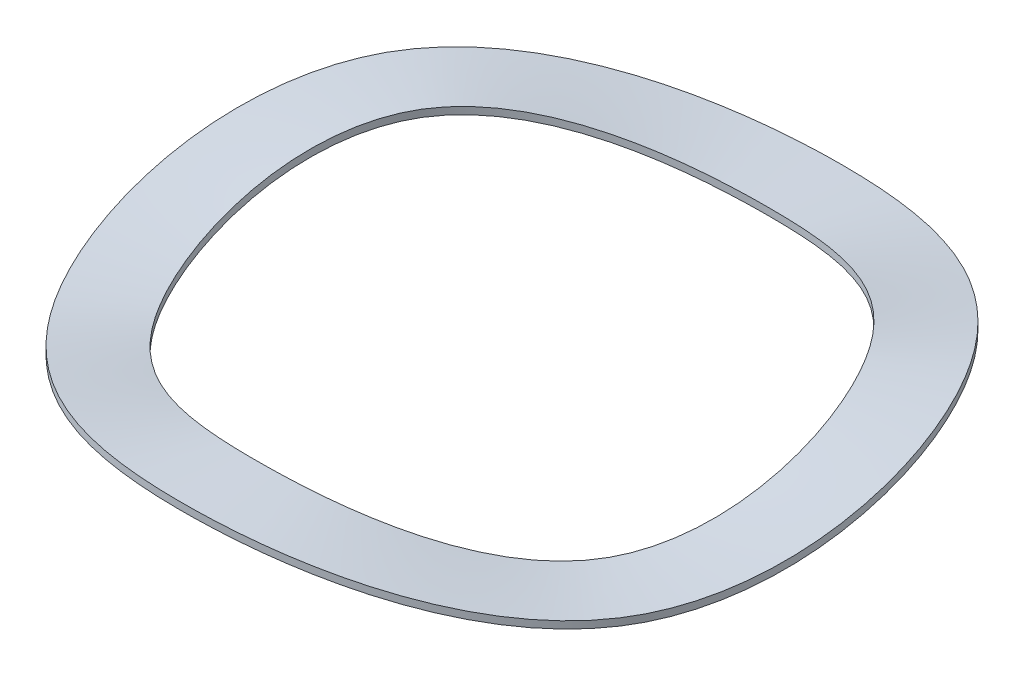
ISO-10303-21;
HEADER;
FILE_DESCRIPTION(('STEP AP214'),'2;1');
FILE_NAME('part.step','',(''),(''),'','','');
FILE_SCHEMA(('AUTOMOTIVE_DESIGN { 1 0 10303 214 1 1 1 1 }'));
ENDSEC;
DATA;
#1=APPLICATION_CONTEXT('core data for automotive mechanical design processes');
#2=APPLICATION_PROTOCOL_DEFINITION('international standard','automotive_design',2000,#1);
#3=PRODUCT_CONTEXT('',#1,'mechanical');
#4=PRODUCT('Part','Part','',(#3));
#5=PRODUCT_RELATED_PRODUCT_CATEGORY('part','',(#4));
#6=PRODUCT_DEFINITION_FORMATION('','',#4);
#7=PRODUCT_DEFINITION_CONTEXT('part definition',#1,'design');
#8=PRODUCT_DEFINITION('design','',#6,#7);
#9=PRODUCT_DEFINITION_SHAPE('','',#8);
#10=(LENGTH_UNIT() NAMED_UNIT(*) SI_UNIT(.MILLI.,.METRE.));
#11=(NAMED_UNIT(*) PLANE_ANGLE_UNIT() SI_UNIT($,.RADIAN.));
#12=(NAMED_UNIT(*) SI_UNIT($,.STERADIAN.) SOLID_ANGLE_UNIT());
#13=UNCERTAINTY_MEASURE_WITH_UNIT(LENGTH_MEASURE(1.E-05),#10,'distance_accuracy_value','');
#14=(GEOMETRIC_REPRESENTATION_CONTEXT(3) GLOBAL_UNCERTAINTY_ASSIGNED_CONTEXT((#13)) GLOBAL_UNIT_ASSIGNED_CONTEXT((#10,
#11,#12)) REPRESENTATION_CONTEXT('',''));
#15=CARTESIAN_POINT('',(0.,0.,0.));
#16=DIRECTION('',(0.,0.,1.));
#17=DIRECTION('',(1.,0.,0.));
#18=AXIS2_PLACEMENT_3D('',#15,#16,#17);
#19=CARTESIAN_POINT('',(0.,0.,-10.8712));
#20=CARTESIAN_POINT('',(3.76589414784855,0.,-10.8712));
#21=CARTESIAN_POINT('',(11.2976824435457,3.2004,-6.52272));
#22=CARTESIAN_POINT('',(11.2976824435456,-1.6002,6.52272000000004));
#23=CARTESIAN_POINT('',(0.,3.20039999999999,13.04544));
#24=CARTESIAN_POINT('',(-11.2976824435457,-1.6002,6.52271999999994));
#25=CARTESIAN_POINT('',(-11.2976824435456,1.6002,-2.17424000000005));
#26=CARTESIAN_POINT('',(-7.53178829569708,1.6002,-8.69696000000003));
#27=CARTESIAN_POINT('',(-3.76589414784855,0.,-10.8712));
#28=CARTESIAN_POINT('',(0.,0.,-10.8712));
#29=CARTESIAN_POINT('',(0.,0.,-11.9126));
#30=CARTESIAN_POINT('',(4.126645690049,0.,-11.9126));
#31=CARTESIAN_POINT('',(12.379937070147,3.2004,-7.14756000000001));
#32=CARTESIAN_POINT('',(12.379937070147,-1.6002,7.14756000000004));
#33=CARTESIAN_POINT('',(0.,3.20039999999999,14.29512));
#34=CARTESIAN_POINT('',(-12.3799370701471,-1.6002,7.14755999999993));
#35=CARTESIAN_POINT('',(-12.379937070147,1.6002,-2.38252000000005));
#36=CARTESIAN_POINT('',(-8.25329138009797,1.6002,-9.53008000000003));
#37=CARTESIAN_POINT('',(-4.12664569004899,0.,-11.9126));
#38=CARTESIAN_POINT('',(0.,0.,-11.9126));
#39=CARTESIAN_POINT('',(0.,0.,-12.954));
#40=CARTESIAN_POINT('',(4.48739723224945,0.,-12.954));
#41=CARTESIAN_POINT('',(13.4621916967484,3.2004,-7.77240000000001));
#42=CARTESIAN_POINT('',(13.4621916967483,-1.6002,7.77240000000005));
#43=CARTESIAN_POINT('',(0.,3.20039999999999,15.5448));
#44=CARTESIAN_POINT('',(-13.4621916967484,-1.6002,7.77239999999993));
#45=CARTESIAN_POINT('',(-13.4621916967483,1.6002,-2.59080000000006));
#46=CARTESIAN_POINT('',(-8.97479446449886,1.6002,-10.3632));
#47=CARTESIAN_POINT('',(-4.48739723224944,0.,-12.954));
#48=CARTESIAN_POINT('',(0.,0.,-12.954));
#49=CARTESIAN_POINT('',(0.,0.,-13.9954));
#50=CARTESIAN_POINT('',(4.84814877444989,0.,-13.9954));
#51=CARTESIAN_POINT('',(14.5444463233497,3.2004,-8.39724000000001));
#52=CARTESIAN_POINT('',(14.5444463233496,-1.6002,8.39724000000005));
#53=CARTESIAN_POINT('',(0.,3.20039999999999,16.79448));
#54=CARTESIAN_POINT('',(-14.5444463233498,-1.6002,8.39723999999993));
#55=CARTESIAN_POINT('',(-14.5444463233497,1.6002,-2.79908000000007));
#56=CARTESIAN_POINT('',(-9.69629754889975,1.6002,-11.19632));
#57=CARTESIAN_POINT('',(-4.84814877444989,0.,-13.9954));
#58=CARTESIAN_POINT('',(0.,0.,-13.9954));
#59=B_SPLINE_SURFACE_WITH_KNOTS('',3,3,((#19,#20,#21,#22,#23,#24,#25,#26,#27,#28),(#29,#30,#31,
#32,#33,#34,#35,#36,#37,#38),(#39,#40,#41,#42,#43,#44,#45,#46,#47,#48),(#49,#50,#51,#52,#53,#54,
#55,#56,#57,#58)),.UNSPECIFIED.,.F.,.T.,.F.,(4,4),(4,1,1,1,1,2,4),(0.,1.),(0.,0.166666666666667,
0.333333333333334,0.5,0.666666666666666,0.833333333333333,1.),.UNSPECIFIED.);
#60=CARTESIAN_POINT('',(0.,0.,-10.8712));
#61=CARTESIAN_POINT('',(3.76589414784855,0.,-10.8712));
#62=CARTESIAN_POINT('',(11.2976824435457,3.2004,-6.52272));
#63=CARTESIAN_POINT('',(11.2976824435456,-1.6002,6.52272000000004));
#64=CARTESIAN_POINT('',(0.,3.20039999999999,13.04544));
#65=CARTESIAN_POINT('',(-11.2976824435457,-1.6002,6.52271999999994));
#66=CARTESIAN_POINT('',(-11.2976824435456,1.6002,-2.17424000000005));
#67=CARTESIAN_POINT('',(-7.53178829569708,1.6002,-8.69696000000003));
#68=CARTESIAN_POINT('',(-3.76589414784855,0.,-10.8712));
#69=CARTESIAN_POINT('',(0.,0.,-10.8712));
#70=B_SPLINE_CURVE_WITH_KNOTS('',3,(#60,#61,#62,#63,#64,#65,#66,#67,#68,#69),.UNSPECIFIED.,.T.,
.F.,(4,1,1,1,1,2,4),(0.,0.166666666666667,0.333333333333334,0.5,0.666666666666666,
0.833333333333333,1.),.UNSPECIFIED.);
#71=CARTESIAN_POINT('',(0.,0.,-10.8712));
#72=VERTEX_POINT('',#71);
#73=EDGE_CURVE('E31',#72,#72,#70,.T.);
#74=CARTESIAN_POINT('',(0.,0.,-13.9954));
#75=CARTESIAN_POINT('',(4.84814877444989,0.,-13.9954));
#76=CARTESIAN_POINT('',(14.5444463233497,3.2004,-8.39724000000001));
#77=CARTESIAN_POINT('',(14.5444463233496,-1.6002,8.39724000000005));
#78=CARTESIAN_POINT('',(0.,3.20039999999999,16.79448));
#79=CARTESIAN_POINT('',(-14.5444463233498,-1.6002,8.39723999999993));
#80=CARTESIAN_POINT('',(-14.5444463233497,1.6002,-2.79908000000007));
#81=CARTESIAN_POINT('',(-9.69629754889975,1.6002,-11.19632));
#82=CARTESIAN_POINT('',(-4.84814877444989,0.,-13.9954));
#83=CARTESIAN_POINT('',(0.,0.,-13.9954));
#84=B_SPLINE_CURVE_WITH_KNOTS('',3,(#74,#75,#76,#77,#78,#79,#80,#81,#82,#83),.UNSPECIFIED.,.T.,
.F.,(4,1,1,1,1,2,4),(0.,0.166666666666667,0.333333333333334,0.5,0.666666666666666,
0.833333333333333,1.),.UNSPECIFIED.);
#85=CARTESIAN_POINT('',(0.,0.,-13.9954));
#86=VERTEX_POINT('',#85);
#87=EDGE_CURVE('E20',#86,#86,#84,.F.);
#88=ORIENTED_EDGE('',*,*,#73,.F.);
#89=EDGE_LOOP('',(#88));
#90=FACE_BOUND('',#89,.T.);
#91=ORIENTED_EDGE('',*,*,#87,.F.);
#92=EDGE_LOOP('',(#91));
#93=FACE_BOUND('',#92,.T.);
#94=ADVANCED_FACE('F14',(#90,#93),#59,.T.);
#95=CARTESIAN_POINT('',(0.,0.,-13.9954));
#96=CARTESIAN_POINT('',(4.84814877444989,0.,-13.9954));
#97=CARTESIAN_POINT('',(14.5444463233497,3.2004,-8.39724000000001));
#98=CARTESIAN_POINT('',(14.5444463233496,-1.6002,8.39724000000005));
#99=CARTESIAN_POINT('',(0.,3.20039999999999,16.79448));
#100=CARTESIAN_POINT('',(-14.5444463233498,-1.6002,8.39723999999993));
#101=CARTESIAN_POINT('',(-14.5444463233497,1.6002,-2.79908000000007));
#102=CARTESIAN_POINT('',(-9.69629754889975,1.6002,-11.19632));
#103=CARTESIAN_POINT('',(-4.84814877444989,0.,-13.9954));
#104=CARTESIAN_POINT('',(0.,0.,-13.9954));
#105=CARTESIAN_POINT('',(0.,0.1016,-13.9954));
#106=CARTESIAN_POINT('',(4.84814877444989,0.101599999999999,-13.9954));
#107=CARTESIAN_POINT('',(14.5444463233497,3.302,-8.39724000000001));
#108=CARTESIAN_POINT('',(14.5444463233496,-1.4986,8.39724000000005));
#109=CARTESIAN_POINT('',(0.,3.30199999999999,16.79448));
#110=CARTESIAN_POINT('',(-14.5444463233498,-1.4986,8.39723999999993));
#111=CARTESIAN_POINT('',(-14.5444463233497,1.7018,-2.79908000000007));
#112=CARTESIAN_POINT('',(-9.69629754889975,1.7018,-11.19632));
#113=CARTESIAN_POINT('',(-4.84814877444989,0.101600000000001,-13.9954));
#114=CARTESIAN_POINT('',(0.,0.1016,-13.9954));
#115=CARTESIAN_POINT('',(0.,0.2032,-13.9954));
#116=CARTESIAN_POINT('',(4.84814877444989,0.203199999999999,-13.9954));
#117=CARTESIAN_POINT('',(14.5444463233497,3.4036,-8.39724000000001));
#118=CARTESIAN_POINT('',(14.5444463233496,-1.397,8.39724000000005));
#119=CARTESIAN_POINT('',(0.,3.40359999999999,16.79448));
#120=CARTESIAN_POINT('',(-14.5444463233498,-1.397,8.39723999999993));
#121=CARTESIAN_POINT('',(-14.5444463233497,1.8034,-2.79908000000007));
#122=CARTESIAN_POINT('',(-9.69629754889975,1.8034,-11.19632));
#123=CARTESIAN_POINT('',(-4.84814877444989,0.203200000000001,-13.9954));
#124=CARTESIAN_POINT('',(0.,0.2032,-13.9954));
#125=CARTESIAN_POINT('',(0.,0.3048,-13.9954));
#126=CARTESIAN_POINT('',(4.84814877444989,0.304799999999999,-13.9954));
#127=CARTESIAN_POINT('',(14.5444463233497,3.5052,-8.39724000000001));
#128=CARTESIAN_POINT('',(14.5444463233496,-1.2954,8.39724000000005));
#129=CARTESIAN_POINT('',(0.,3.50519999999999,16.79448));
#130=CARTESIAN_POINT('',(-14.5444463233498,-1.2954,8.39723999999993));
#131=CARTESIAN_POINT('',(-14.5444463233497,1.905,-2.79908000000007));
#132=CARTESIAN_POINT('',(-9.69629754889975,1.905,-11.19632));
#133=CARTESIAN_POINT('',(-4.84814877444989,0.304800000000001,-13.9954));
#134=CARTESIAN_POINT('',(0.,0.3048,-13.9954));
#135=B_SPLINE_SURFACE_WITH_KNOTS('',3,3,((#95,#96,#97,#98,#99,#100,#101,#102,#103,#104),(#105,
#106,#107,#108,#109,#110,#111,#112,#113,#114),(#115,#116,#117,#118,#119,#120,#121,#122,#123,
#124),(#125,#126,#127,#128,#129,#130,#131,#132,#133,#134)),.UNSPECIFIED.,.F.,.T.,.F.,(4,4),(4,1,
1,1,1,2,4),(0.,1.),(0.,0.166666666666667,0.333333333333334,0.5,0.666666666666666,
0.833333333333333,1.),.UNSPECIFIED.);
#136=CARTESIAN_POINT('',(0.,0.3048,-13.9954));
#137=CARTESIAN_POINT('',(4.84814877444989,0.304799999999999,-13.9954));
#138=CARTESIAN_POINT('',(14.5444463233497,3.5052,-8.39724000000001));
#139=CARTESIAN_POINT('',(14.5444463233496,-1.2954,8.39724000000005));
#140=CARTESIAN_POINT('',(0.,3.50519999999999,16.79448));
#141=CARTESIAN_POINT('',(-14.5444463233498,-1.2954,8.39723999999993));
#142=CARTESIAN_POINT('',(-14.5444463233497,1.905,-2.79908000000007));
#143=CARTESIAN_POINT('',(-9.69629754889975,1.905,-11.19632));
#144=CARTESIAN_POINT('',(-4.84814877444989,0.304800000000001,-13.9954));
#145=CARTESIAN_POINT('',(0.,0.3048,-13.9954));
#146=B_SPLINE_CURVE_WITH_KNOTS('',3,(#136,#137,#138,#139,#140,#141,#142,#143,#144,#145),
.UNSPECIFIED.,.T.,.F.,(4,1,1,1,1,2,4),(0.,0.166666666666667,0.333333333333334,0.5,
0.666666666666666,0.833333333333333,1.),.UNSPECIFIED.);
#147=CARTESIAN_POINT('',(0.,0.3048,-13.9954));
#148=VERTEX_POINT('',#147);
#149=EDGE_CURVE('E26',#148,#148,#146,.F.);
#150=ORIENTED_EDGE('',*,*,#87,.T.);
#151=EDGE_LOOP('',(#150));
#152=FACE_BOUND('',#151,.T.);
#153=ORIENTED_EDGE('',*,*,#149,.F.);
#154=EDGE_LOOP('',(#153));
#155=FACE_BOUND('',#154,.T.);
#156=ADVANCED_FACE('F54',(#152,#155),#135,.T.);
#157=CARTESIAN_POINT('',(0.,0.3048,-10.8712));
#158=CARTESIAN_POINT('',(3.76589414784855,0.304799999999998,-10.8712));
#159=CARTESIAN_POINT('',(11.2976824435457,3.5052,-6.52272));
#160=CARTESIAN_POINT('',(11.2976824435456,-1.2954,6.52272000000004));
#161=CARTESIAN_POINT('',(0.,3.5052,13.04544));
#162=CARTESIAN_POINT('',(-11.2976824435457,-1.29540000000002,6.52271999999994));
#163=CARTESIAN_POINT('',(-11.2976824435456,1.905,-2.17424000000005));
#164=CARTESIAN_POINT('',(-7.53178829569708,1.905,-8.69696000000003));
#165=CARTESIAN_POINT('',(-3.76589414784855,0.304800000000001,-10.8712));
#166=CARTESIAN_POINT('',(0.,0.3048,-10.8712));
#167=CARTESIAN_POINT('',(0.,0.2032,-10.8712));
#168=CARTESIAN_POINT('',(3.76589414784855,0.203199999999998,-10.8712));
#169=CARTESIAN_POINT('',(11.2976824435457,3.4036,-6.52272));
#170=CARTESIAN_POINT('',(11.2976824435456,-1.397,6.52272000000004));
#171=CARTESIAN_POINT('',(0.,3.4036,13.04544));
#172=CARTESIAN_POINT('',(-11.2976824435457,-1.39700000000001,6.52271999999994));
#173=CARTESIAN_POINT('',(-11.2976824435456,1.8034,-2.17424000000005));
#174=CARTESIAN_POINT('',(-7.53178829569708,1.8034,-8.69696000000003));
#175=CARTESIAN_POINT('',(-3.76589414784855,0.203200000000001,-10.8712));
#176=CARTESIAN_POINT('',(0.,0.2032,-10.8712));
#177=CARTESIAN_POINT('',(0.,0.1016,-10.8712));
#178=CARTESIAN_POINT('',(3.76589414784855,0.101599999999999,-10.8712));
#179=CARTESIAN_POINT('',(11.2976824435457,3.302,-6.52272));
#180=CARTESIAN_POINT('',(11.2976824435456,-1.4986,6.52272000000004));
#181=CARTESIAN_POINT('',(0.,3.302,13.04544));
#182=CARTESIAN_POINT('',(-11.2976824435457,-1.49860000000001,6.52271999999994));
#183=CARTESIAN_POINT('',(-11.2976824435456,1.7018,-2.17424000000005));
#184=CARTESIAN_POINT('',(-7.53178829569708,1.7018,-8.69696000000003));
#185=CARTESIAN_POINT('',(-3.76589414784855,0.101600000000001,-10.8712));
#186=CARTESIAN_POINT('',(0.,0.1016,-10.8712));
#187=CARTESIAN_POINT('',(0.,0.,-10.8712));
#188=CARTESIAN_POINT('',(3.76589414784855,0.,-10.8712));
#189=CARTESIAN_POINT('',(11.2976824435457,3.2004,-6.52272));
#190=CARTESIAN_POINT('',(11.2976824435456,-1.6002,6.52272000000004));
#191=CARTESIAN_POINT('',(0.,3.20039999999999,13.04544));
#192=CARTESIAN_POINT('',(-11.2976824435457,-1.6002,6.52271999999994));
#193=CARTESIAN_POINT('',(-11.2976824435456,1.6002,-2.17424000000005));
#194=CARTESIAN_POINT('',(-7.53178829569708,1.6002,-8.69696000000003));
#195=CARTESIAN_POINT('',(-3.76589414784855,0.,-10.8712));
#196=CARTESIAN_POINT('',(0.,0.,-10.8712));
#197=B_SPLINE_SURFACE_WITH_KNOTS('',3,3,((#157,#158,#159,#160,#161,#162,#163,#164,#165,#166),
(#167,#168,#169,#170,#171,#172,#173,#174,#175,#176),(#177,#178,#179,#180,#181,#182,#183,#184,
#185,#186),(#187,#188,#189,#190,#191,#192,#193,#194,#195,#196)),.UNSPECIFIED.,.F.,.T.,.F.,(4,4),
(4,1,1,1,1,2,4),(0.,1.),(0.,0.166666666666667,0.333333333333334,0.5,0.666666666666666,
0.833333333333333,1.),.UNSPECIFIED.);
#198=CARTESIAN_POINT('',(0.,0.3048,-10.8712));
#199=CARTESIAN_POINT('',(3.76589414784855,0.304799999999998,-10.8712));
#200=CARTESIAN_POINT('',(11.2976824435457,3.5052,-6.52272));
#201=CARTESIAN_POINT('',(11.2976824435456,-1.2954,6.52272000000004));
#202=CARTESIAN_POINT('',(0.,3.5052,13.04544));
#203=CARTESIAN_POINT('',(-11.2976824435457,-1.29540000000002,6.52271999999994));
#204=CARTESIAN_POINT('',(-11.2976824435456,1.905,-2.17424000000005));
#205=CARTESIAN_POINT('',(-7.53178829569708,1.905,-8.69696000000003));
#206=CARTESIAN_POINT('',(-3.76589414784855,0.304800000000001,-10.8712));
#207=CARTESIAN_POINT('',(0.,0.3048,-10.8712));
#208=B_SPLINE_CURVE_WITH_KNOTS('',3,(#198,#199,#200,#201,#202,#203,#204,#205,#206,#207),
.UNSPECIFIED.,.T.,.F.,(4,1,1,1,1,2,4),(0.,0.166666666666667,0.333333333333334,0.5,
0.666666666666666,0.833333333333333,1.),.UNSPECIFIED.);
#209=CARTESIAN_POINT('',(0.,0.3048,-10.8712));
#210=VERTEX_POINT('',#209);
#211=EDGE_CURVE('E10',#210,#210,#208,.T.);
#212=ORIENTED_EDGE('',*,*,#73,.T.);
#213=EDGE_LOOP('',(#212));
#214=FACE_BOUND('',#213,.T.);
#215=ORIENTED_EDGE('',*,*,#211,.F.);
#216=EDGE_LOOP('',(#215));
#217=FACE_BOUND('',#216,.T.);
#218=ADVANCED_FACE('F64',(#214,#217),#197,.T.);
#219=CARTESIAN_POINT('',(0.,0.3048,-13.9954));
#220=CARTESIAN_POINT('',(4.84814877444989,0.304799999999999,-13.9954));
#221=CARTESIAN_POINT('',(14.5444463233497,3.5052,-8.39724000000001));
#222=CARTESIAN_POINT('',(14.5444463233496,-1.2954,8.39724000000005));
#223=CARTESIAN_POINT('',(0.,3.50519999999999,16.79448));
#224=CARTESIAN_POINT('',(-14.5444463233498,-1.2954,8.39723999999993));
#225=CARTESIAN_POINT('',(-14.5444463233497,1.905,-2.79908000000007));
#226=CARTESIAN_POINT('',(-9.69629754889975,1.905,-11.19632));
#227=CARTESIAN_POINT('',(-4.84814877444989,0.304800000000001,-13.9954));
#228=CARTESIAN_POINT('',(0.,0.3048,-13.9954));
#229=CARTESIAN_POINT('',(0.,0.3048,-12.954));
#230=CARTESIAN_POINT('',(4.48739723224945,0.304799999999999,-12.954));
#231=CARTESIAN_POINT('',(13.4621916967484,3.5052,-7.77240000000001));
#232=CARTESIAN_POINT('',(13.4621916967483,-1.2954,7.77240000000005));
#233=CARTESIAN_POINT('',(0.,3.5052,15.5448));
#234=CARTESIAN_POINT('',(-13.4621916967484,-1.29540000000001,7.77239999999993));
#235=CARTESIAN_POINT('',(-13.4621916967483,1.905,-2.59080000000006));
#236=CARTESIAN_POINT('',(-8.97479446449886,1.905,-10.3632));
#237=CARTESIAN_POINT('',(-4.48739723224944,0.304800000000001,-12.954));
#238=CARTESIAN_POINT('',(0.,0.3048,-12.954));
#239=CARTESIAN_POINT('',(0.,0.3048,-11.9126));
#240=CARTESIAN_POINT('',(4.126645690049,0.304799999999998,-11.9126));
#241=CARTESIAN_POINT('',(12.379937070147,3.5052,-7.14756));
#242=CARTESIAN_POINT('',(12.379937070147,-1.2954,7.14756000000004));
#243=CARTESIAN_POINT('',(0.,3.5052,14.29512));
#244=CARTESIAN_POINT('',(-12.3799370701471,-1.29540000000001,7.14755999999993));
#245=CARTESIAN_POINT('',(-12.379937070147,1.905,-2.38252000000005));
#246=CARTESIAN_POINT('',(-8.25329138009797,1.905,-9.53008000000003));
#247=CARTESIAN_POINT('',(-4.12664569004899,0.304800000000001,-11.9126));
#248=CARTESIAN_POINT('',(0.,0.3048,-11.9126));
#249=CARTESIAN_POINT('',(0.,0.3048,-10.8712));
#250=CARTESIAN_POINT('',(3.76589414784855,0.304799999999998,-10.8712));
#251=CARTESIAN_POINT('',(11.2976824435457,3.5052,-6.52272));
#252=CARTESIAN_POINT('',(11.2976824435456,-1.2954,6.52272000000004));
#253=CARTESIAN_POINT('',(0.,3.5052,13.04544));
#254=CARTESIAN_POINT('',(-11.2976824435457,-1.29540000000002,6.52271999999994));
#255=CARTESIAN_POINT('',(-11.2976824435456,1.905,-2.17424000000005));
#256=CARTESIAN_POINT('',(-7.53178829569708,1.905,-8.69696000000003));
#257=CARTESIAN_POINT('',(-3.76589414784855,0.304800000000001,-10.8712));
#258=CARTESIAN_POINT('',(0.,0.3048,-10.8712));
#259=B_SPLINE_SURFACE_WITH_KNOTS('',3,3,((#219,#220,#221,#222,#223,#224,#225,#226,#227,#228),
(#229,#230,#231,#232,#233,#234,#235,#236,#237,#238),(#239,#240,#241,#242,#243,#244,#245,#246,
#247,#248),(#249,#250,#251,#252,#253,#254,#255,#256,#257,#258)),.UNSPECIFIED.,.F.,.T.,.F.,(4,4),
(4,1,1,1,1,2,4),(0.,1.),(0.,0.166666666666667,0.333333333333334,0.5,0.666666666666666,
0.833333333333333,1.),.UNSPECIFIED.);
#260=ORIENTED_EDGE('',*,*,#149,.T.);
#261=EDGE_LOOP('',(#260));
#262=FACE_BOUND('',#261,.T.);
#263=ORIENTED_EDGE('',*,*,#211,.T.);
#264=EDGE_LOOP('',(#263));
#265=FACE_BOUND('',#264,.T.);
#266=ADVANCED_FACE('F16',(#262,#265),#259,.T.);
#267=CLOSED_SHELL('',(#94,#156,#218,#266));
#268=MANIFOLD_SOLID_BREP('B1',#267);
#269=ADVANCED_BREP_SHAPE_REPRESENTATION('',(#18,#268),#14);
#270=SHAPE_DEFINITION_REPRESENTATION(#9,#269);
ENDSEC;
END-ISO-10303-21;
